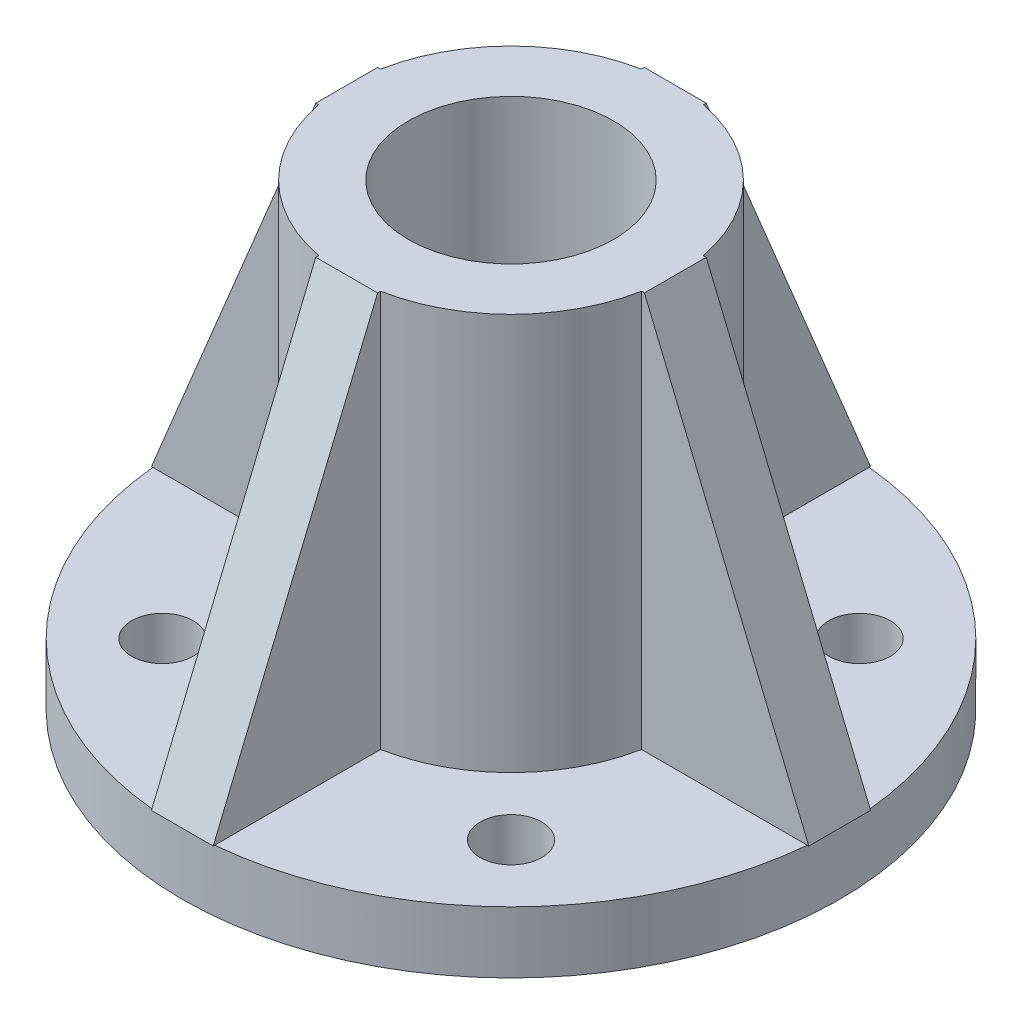
ISO-10303-21;
HEADER;
FILE_DESCRIPTION(('STEP AP214'),'2;1');
FILE_NAME('part.step','',(''),(''),'','','');
FILE_SCHEMA(('AUTOMOTIVE_DESIGN { 1 0 10303 214 1 1 1 1 }'));
ENDSEC;
DATA;
#1=APPLICATION_CONTEXT('core data for automotive mechanical design processes');
#2=APPLICATION_PROTOCOL_DEFINITION('international standard','automotive_design',2000,#1);
#3=PRODUCT_CONTEXT('',#1,'mechanical');
#4=PRODUCT('Part','Part','',(#3));
#5=PRODUCT_RELATED_PRODUCT_CATEGORY('part','',(#4));
#6=PRODUCT_DEFINITION_FORMATION('','',#4);
#7=PRODUCT_DEFINITION_CONTEXT('part definition',#1,'design');
#8=PRODUCT_DEFINITION('design','',#6,#7);
#9=PRODUCT_DEFINITION_SHAPE('','',#8);
#10=(LENGTH_UNIT() NAMED_UNIT(*) SI_UNIT(.MILLI.,.METRE.));
#11=(NAMED_UNIT(*) PLANE_ANGLE_UNIT() SI_UNIT($,.RADIAN.));
#12=(NAMED_UNIT(*) SI_UNIT($,.STERADIAN.) SOLID_ANGLE_UNIT());
#13=UNCERTAINTY_MEASURE_WITH_UNIT(LENGTH_MEASURE(1.E-05),#10,'distance_accuracy_value','');
#14=(GEOMETRIC_REPRESENTATION_CONTEXT(3) GLOBAL_UNCERTAINTY_ASSIGNED_CONTEXT((#13)) GLOBAL_UNIT_ASSIGNED_CONTEXT((#10,
#11,#12)) REPRESENTATION_CONTEXT('',''));
#15=CARTESIAN_POINT('',(0.,0.,0.));
#16=DIRECTION('',(0.,0.,1.));
#17=DIRECTION('',(1.,0.,0.));
#18=AXIS2_PLACEMENT_3D('',#15,#16,#17);
#19=CARTESIAN_POINT('',(0.,9.525,0.));
#20=DIRECTION('',(0.,1.,0.));
#21=DIRECTION('',(0.,0.,1.));
#22=AXIS2_PLACEMENT_3D('',#19,#20,#21);
#23=PLANE('',#22);
#24=CARTESIAN_POINT('',(26.940768363207,9.525,26.9407683632079));
#25=DIRECTION('',(0.,1.,0.));
#26=DIRECTION('',(0.,0.,1.));
#27=AXIS2_PLACEMENT_3D('',#24,#25,#26);
#28=CIRCLE('',#27,4.7625);
#29=CARTESIAN_POINT('',(26.940768363207,9.525,31.7032683632079));
#30=VERTEX_POINT('',#29);
#31=EDGE_CURVE('E464',#30,#30,#28,.T.);
#32=ORIENTED_EDGE('',*,*,#31,.F.);
#33=EDGE_LOOP('',(#32));
#34=FACE_BOUND('',#33,.T.);
#35=CARTESIAN_POINT('',(0.,9.525,0.));
#36=DIRECTION('',(0.,1.,0.));
#37=DIRECTION('',(0.,0.,1.));
#38=AXIS2_PLACEMENT_3D('',#35,#36,#37);
#39=CIRCLE('',#38,25.4);
#40=CARTESIAN_POINT('',(4.77519999999974,9.525,24.9470933168576));
#41=VERTEX_POINT('',#40);
#42=CARTESIAN_POINT('',(24.9470933168576,9.525,4.7752));
#43=VERTEX_POINT('',#42);
#44=EDGE_CURVE('E375',#41,#43,#39,.T.);
#45=ORIENTED_EDGE('',*,*,#44,.F.);
#46=DIRECTION('',(0.,0.,-1.));
#47=VECTOR('',#46,1.);
#48=CARTESIAN_POINT('',(4.77519999999947,9.525,50.8));
#49=LINE('',#48,#47);
#50=CARTESIAN_POINT('',(4.77519999999947,9.525,50.5750676219024));
#51=VERTEX_POINT('',#50);
#52=EDGE_CURVE('E215',#51,#41,#49,.T.);
#53=ORIENTED_EDGE('',*,*,#52,.F.);
#54=CARTESIAN_POINT('',(0.,9.525,0.));
#55=DIRECTION('',(0.,1.,0.));
#56=DIRECTION('',(0.,0.,1.));
#57=AXIS2_PLACEMENT_3D('',#54,#55,#56);
#58=CIRCLE('',#57,50.8);
#59=CARTESIAN_POINT('',(50.5750676219024,9.525,4.7752));
#60=VERTEX_POINT('',#59);
#61=EDGE_CURVE('E52',#51,#60,#58,.T.);
#62=ORIENTED_EDGE('',*,*,#61,.T.);
#63=DIRECTION('',(-1.,0.,0.));
#64=VECTOR('',#63,1.);
#65=CARTESIAN_POINT('',(50.8,9.525,4.7752));
#66=LINE('',#65,#64);
#67=EDGE_CURVE('E256',#60,#43,#66,.T.);
#68=ORIENTED_EDGE('',*,*,#67,.T.);
#69=EDGE_LOOP('',(#45,#53,#62,#68));
#70=FACE_BOUND('',#69,.T.);
#71=ADVANCED_FACE('F41',(#34,#70),#23,.T.);
#72=CARTESIAN_POINT('',(0.,213.574048968553,0.));
#73=DIRECTION('',(0.,-1.,0.));
#74=DIRECTION('',(0.,0.,-1.));
#75=AXIS2_PLACEMENT_3D('',#72,#73,#74);
#76=CYLINDRICAL_SURFACE('',#75,25.4);
#77=DIRECTION('',(0.,-1.,0.));
#78=VECTOR('',#77,1.);
#79=CARTESIAN_POINT('',(4.77519999999974,213.574048968553,24.9470933168576));
#80=LINE('',#79,#78);
#81=CARTESIAN_POINT('',(4.77519999999974,70.866,24.9470933168576));
#82=VERTEX_POINT('',#81);
#83=EDGE_CURVE('E59',#41,#82,#80,.F.);
#84=ORIENTED_EDGE('',*,*,#83,.F.);
#85=ORIENTED_EDGE('',*,*,#44,.T.);
#86=DIRECTION('',(0.,-1.,0.));
#87=VECTOR('',#86,1.);
#88=CARTESIAN_POINT('',(24.9470933168576,213.574048968553,4.7752));
#89=LINE('',#88,#87);
#90=CARTESIAN_POINT('',(24.9470933168576,70.866,4.7752));
#91=VERTEX_POINT('',#90);
#92=EDGE_CURVE('E267',#43,#91,#89,.F.);
#93=ORIENTED_EDGE('',*,*,#92,.T.);
#94=CARTESIAN_POINT('',(0.,70.866,0.));
#95=DIRECTION('',(0.,1.,0.));
#96=DIRECTION('',(0.,0.,1.));
#97=AXIS2_PLACEMENT_3D('',#94,#95,#96);
#98=CIRCLE('',#97,25.4);
#99=EDGE_CURVE('E370',#82,#91,#98,.T.);
#100=ORIENTED_EDGE('',*,*,#99,.F.);
#101=EDGE_LOOP('',(#84,#85,#93,#100));
#102=FACE_BOUND('',#101,.T.);
#103=ADVANCED_FACE('F475',(#102),#76,.T.);
#104=CARTESIAN_POINT('',(26.9407683632076,9.525,-26.9407683632073));
#105=DIRECTION('',(0.,1.,0.));
#106=DIRECTION('',(0.,0.,1.));
#107=AXIS2_PLACEMENT_3D('',#104,#105,#106);
#108=CIRCLE('',#107,4.7625);
#109=CARTESIAN_POINT('',(26.9407683632076,9.525,-22.1782683632073));
#110=VERTEX_POINT('',#109);
#111=EDGE_CURVE('E456',#110,#110,#108,.T.);
#112=ORIENTED_EDGE('',*,*,#111,.F.);
#113=EDGE_LOOP('',(#112));
#114=FACE_BOUND('',#113,.T.);
#115=CARTESIAN_POINT('',(24.9470933168576,9.525,-4.7752));
#116=VERTEX_POINT('',#115);
#117=CARTESIAN_POINT('',(4.77520000000009,9.525,-24.9470933168576));
#118=VERTEX_POINT('',#117);
#119=EDGE_CURVE('E483',#116,#118,#39,.T.);
#120=ORIENTED_EDGE('',*,*,#119,.F.);
#121=DIRECTION('',(-1.,0.,0.));
#122=VECTOR('',#121,1.);
#123=CARTESIAN_POINT('',(50.8,9.525,-4.7752));
#124=LINE('',#123,#122);
#125=CARTESIAN_POINT('',(50.5750676219024,9.525,-4.7752));
#126=VERTEX_POINT('',#125);
#127=EDGE_CURVE('E243',#126,#116,#124,.T.);
#128=ORIENTED_EDGE('',*,*,#127,.F.);
#129=CARTESIAN_POINT('',(4.77520000000018,9.525,-50.5750676219024));
#130=VERTEX_POINT('',#129);
#131=EDGE_CURVE('E409',#126,#130,#58,.T.);
#132=ORIENTED_EDGE('',*,*,#131,.T.);
#133=DIRECTION('',(0.,0.,1.));
#134=VECTOR('',#133,1.);
#135=CARTESIAN_POINT('',(4.77520000000018,9.525,-50.8));
#136=LINE('',#135,#134);
#137=EDGE_CURVE('E296',#130,#118,#136,.T.);
#138=ORIENTED_EDGE('',*,*,#137,.T.);
#139=EDGE_LOOP('',(#120,#128,#132,#138));
#140=FACE_BOUND('',#139,.T.);
#141=ADVANCED_FACE('F477',(#114,#140),#23,.T.);
#142=DIRECTION('',(0.,-1.,0.));
#143=VECTOR('',#142,1.);
#144=CARTESIAN_POINT('',(24.9470933168576,213.574048968553,-4.7752));
#145=LINE('',#144,#143);
#146=CARTESIAN_POINT('',(24.9470933168576,70.866,-4.7752));
#147=VERTEX_POINT('',#146);
#148=EDGE_CURVE('E271',#116,#147,#145,.F.);
#149=ORIENTED_EDGE('',*,*,#148,.F.);
#150=ORIENTED_EDGE('',*,*,#119,.T.);
#151=DIRECTION('',(0.,-1.,0.));
#152=VECTOR('',#151,1.);
#153=CARTESIAN_POINT('',(4.77520000000009,213.574048968553,-24.9470933168576));
#154=LINE('',#153,#152);
#155=CARTESIAN_POINT('',(4.77520000000009,70.866,-24.9470933168576));
#156=VERTEX_POINT('',#155);
#157=EDGE_CURVE('E307',#118,#156,#154,.F.);
#158=ORIENTED_EDGE('',*,*,#157,.T.);
#159=EDGE_CURVE('E518',#147,#156,#98,.T.);
#160=ORIENTED_EDGE('',*,*,#159,.F.);
#161=EDGE_LOOP('',(#149,#150,#158,#160));
#162=FACE_BOUND('',#161,.T.);
#163=ADVANCED_FACE('F517',(#162),#76,.T.);
#164=CARTESIAN_POINT('',(-26.9407683632072,9.525,-26.9407683632077));
#165=DIRECTION('',(0.,1.,0.));
#166=DIRECTION('',(0.,0.,1.));
#167=AXIS2_PLACEMENT_3D('',#164,#165,#166);
#168=CIRCLE('',#167,4.7625);
#169=CARTESIAN_POINT('',(-26.9407683632072,9.525,-22.1782683632077));
#170=VERTEX_POINT('',#169);
#171=EDGE_CURVE('E448',#170,#170,#168,.T.);
#172=ORIENTED_EDGE('',*,*,#171,.F.);
#173=EDGE_LOOP('',(#172));
#174=FACE_BOUND('',#173,.T.);
#175=CARTESIAN_POINT('',(-4.77519999999991,9.525,-24.9470933168576));
#176=VERTEX_POINT('',#175);
#177=CARTESIAN_POINT('',(-24.9470933168576,9.525,-4.7752));
#178=VERTEX_POINT('',#177);
#179=EDGE_CURVE('E376',#176,#178,#39,.T.);
#180=ORIENTED_EDGE('',*,*,#179,.F.);
#181=DIRECTION('',(0.,0.,1.));
#182=VECTOR('',#181,1.);
#183=CARTESIAN_POINT('',(-4.77519999999982,9.525,-50.8));
#184=LINE('',#183,#182);
#185=CARTESIAN_POINT('',(-4.77519999999982,9.525,-50.5750676219024));
#186=VERTEX_POINT('',#185);
#187=EDGE_CURVE('E283',#186,#176,#184,.T.);
#188=ORIENTED_EDGE('',*,*,#187,.F.);
#189=CARTESIAN_POINT('',(-50.5750676219024,9.525,-4.7752));
#190=VERTEX_POINT('',#189);
#191=EDGE_CURVE('E386',#186,#190,#58,.T.);
#192=ORIENTED_EDGE('',*,*,#191,.T.);
#193=DIRECTION('',(1.,0.,0.));
#194=VECTOR('',#193,1.);
#195=CARTESIAN_POINT('',(-50.8,9.525,-4.7752));
#196=LINE('',#195,#194);
#197=EDGE_CURVE('E344',#190,#178,#196,.T.);
#198=ORIENTED_EDGE('',*,*,#197,.T.);
#199=EDGE_LOOP('',(#180,#188,#192,#198));
#200=FACE_BOUND('',#199,.T.);
#201=ADVANCED_FACE('F498',(#174,#200),#23,.T.);
#202=DIRECTION('',(0.,-1.,0.));
#203=VECTOR('',#202,1.);
#204=CARTESIAN_POINT('',(-4.77519999999991,213.574048968553,-24.9470933168576));
#205=LINE('',#204,#203);
#206=CARTESIAN_POINT('',(-4.77519999999991,70.866,-24.9470933168576));
#207=VERTEX_POINT('',#206);
#208=EDGE_CURVE('E311',#176,#207,#205,.F.);
#209=ORIENTED_EDGE('',*,*,#208,.F.);
#210=ORIENTED_EDGE('',*,*,#179,.T.);
#211=DIRECTION('',(0.,-1.,0.));
#212=VECTOR('',#211,1.);
#213=CARTESIAN_POINT('',(-24.9470933168576,213.574048968553,-4.7752));
#214=LINE('',#213,#212);
#215=CARTESIAN_POINT('',(-24.9470933168576,70.866,-4.7752));
#216=VERTEX_POINT('',#215);
#217=EDGE_CURVE('E355',#178,#216,#214,.F.);
#218=ORIENTED_EDGE('',*,*,#217,.T.);
#219=EDGE_CURVE('E371',#207,#216,#98,.T.);
#220=ORIENTED_EDGE('',*,*,#219,.F.);
#221=EDGE_LOOP('',(#209,#210,#218,#220));
#222=FACE_BOUND('',#221,.T.);
#223=ADVANCED_FACE('F491',(#222),#76,.T.);
#224=DIRECTION('',(0.,0.,-1.));
#225=VECTOR('',#224,1.);
#226=CARTESIAN_POINT('',(-4.77520000000053,9.525,50.7999999999999));
#227=LINE('',#226,#225);
#228=CARTESIAN_POINT('',(-4.77520000000053,9.525,50.5750676219023));
#229=VERTEX_POINT('',#228);
#230=CARTESIAN_POINT('',(-4.77520000000026,9.525,24.9470933168575));
#231=VERTEX_POINT('',#230);
#232=EDGE_CURVE('E67',#229,#231,#227,.T.);
#233=ORIENTED_EDGE('',*,*,#232,.T.);
#234=CARTESIAN_POINT('',(-24.9470933168576,9.525,4.7752));
#235=VERTEX_POINT('',#234);
#236=EDGE_CURVE('E372',#235,#231,#39,.T.);
#237=ORIENTED_EDGE('',*,*,#236,.F.);
#238=DIRECTION('',(1.,0.,0.));
#239=VECTOR('',#238,1.);
#240=CARTESIAN_POINT('',(-50.8,9.525,4.7752));
#241=LINE('',#240,#239);
#242=CARTESIAN_POINT('',(-50.5750676219024,9.525,4.7752));
#243=VERTEX_POINT('',#242);
#244=EDGE_CURVE('E331',#243,#235,#241,.T.);
#245=ORIENTED_EDGE('',*,*,#244,.F.);
#246=EDGE_CURVE('E51',#243,#229,#58,.T.);
#247=ORIENTED_EDGE('',*,*,#246,.T.);
#248=EDGE_LOOP('',(#233,#237,#245,#247));
#249=FACE_BOUND('',#248,.T.);
#250=CARTESIAN_POINT('',(-26.9407683632076,9.525,26.9407683632073));
#251=DIRECTION('',(0.,1.,0.));
#252=DIRECTION('',(0.,0.,1.));
#253=AXIS2_PLACEMENT_3D('',#250,#251,#252);
#254=CIRCLE('',#253,4.7625);
#255=CARTESIAN_POINT('',(-26.9407683632076,9.525,31.7032683632073));
#256=VERTEX_POINT('',#255);
#257=EDGE_CURVE('E315',#256,#256,#254,.T.);
#258=ORIENTED_EDGE('',*,*,#257,.F.);
#259=EDGE_LOOP('',(#258));
#260=FACE_BOUND('',#259,.T.);
#261=ADVANCED_FACE('F478',(#249,#260),#23,.T.);
#262=ORIENTED_EDGE('',*,*,#236,.T.);
#263=DIRECTION('',(0.,-1.,0.));
#264=VECTOR('',#263,1.);
#265=CARTESIAN_POINT('',(-4.77520000000026,213.574048968553,24.9470933168575));
#266=LINE('',#265,#264);
#267=CARTESIAN_POINT('',(-4.77520000000026,70.866,24.9470933168575));
#268=VERTEX_POINT('',#267);
#269=EDGE_CURVE('E224',#231,#268,#266,.F.);
#270=ORIENTED_EDGE('',*,*,#269,.T.);
#271=CARTESIAN_POINT('',(-24.9470933168576,70.866,4.7752));
#272=VERTEX_POINT('',#271);
#273=EDGE_CURVE('E366',#272,#268,#98,.T.);
#274=ORIENTED_EDGE('',*,*,#273,.F.);
#275=DIRECTION('',(0.,-1.,0.));
#276=VECTOR('',#275,1.);
#277=CARTESIAN_POINT('',(-24.9470933168576,213.574048968553,4.7752));
#278=LINE('',#277,#276);
#279=EDGE_CURVE('E359',#235,#272,#278,.F.);
#280=ORIENTED_EDGE('',*,*,#279,.F.);
#281=EDGE_LOOP('',(#262,#270,#274,#280));
#282=FACE_BOUND('',#281,.T.);
#283=ADVANCED_FACE('F570',(#282),#76,.T.);
#284=CARTESIAN_POINT('',(0.,0.,0.));
#285=DIRECTION('',(0.,1.,0.));
#286=DIRECTION('',(0.,0.,1.));
#287=AXIS2_PLACEMENT_3D('',#284,#285,#286);
#288=PLANE('',#287);
#289=CARTESIAN_POINT('',(26.940768363207,0.,26.9407683632079));
#290=DIRECTION('',(0.,1.,0.));
#291=DIRECTION('',(0.,0.,1.));
#292=AXIS2_PLACEMENT_3D('',#289,#290,#291);
#293=CIRCLE('',#292,4.7625);
#294=CARTESIAN_POINT('',(26.940768363207,0.,31.7032683632079));
#295=VERTEX_POINT('',#294);
#296=EDGE_CURVE('E460',#295,#295,#293,.T.);
#297=ORIENTED_EDGE('',*,*,#296,.T.);
#298=EDGE_LOOP('',(#297));
#299=FACE_BOUND('',#298,.T.);
#300=CARTESIAN_POINT('',(26.9407683632076,0.,-26.9407683632073));
#301=DIRECTION('',(0.,1.,0.));
#302=DIRECTION('',(0.,0.,1.));
#303=AXIS2_PLACEMENT_3D('',#300,#301,#302);
#304=CIRCLE('',#303,4.7625);
#305=CARTESIAN_POINT('',(26.9407683632076,0.,-22.1782683632073));
#306=VERTEX_POINT('',#305);
#307=EDGE_CURVE('E452',#306,#306,#304,.T.);
#308=ORIENTED_EDGE('',*,*,#307,.T.);
#309=EDGE_LOOP('',(#308));
#310=FACE_BOUND('',#309,.T.);
#311=CARTESIAN_POINT('',(-26.9407683632072,0.,-26.9407683632077));
#312=DIRECTION('',(0.,1.,0.));
#313=DIRECTION('',(0.,0.,1.));
#314=AXIS2_PLACEMENT_3D('',#311,#312,#313);
#315=CIRCLE('',#314,4.7625);
#316=CARTESIAN_POINT('',(-26.9407683632072,0.,-22.1782683632077));
#317=VERTEX_POINT('',#316);
#318=EDGE_CURVE('E440',#317,#317,#315,.T.);
#319=ORIENTED_EDGE('',*,*,#318,.T.);
#320=EDGE_LOOP('',(#319));
#321=FACE_BOUND('',#320,.T.);
#322=CARTESIAN_POINT('',(-26.9407683632076,0.,26.9407683632073));
#323=DIRECTION('',(0.,1.,0.));
#324=DIRECTION('',(0.,0.,1.));
#325=AXIS2_PLACEMENT_3D('',#322,#323,#324);
#326=CIRCLE('',#325,4.7625);
#327=CARTESIAN_POINT('',(-26.9407683632076,0.,31.7032683632073));
#328=VERTEX_POINT('',#327);
#329=EDGE_CURVE('E319',#328,#328,#326,.T.);
#330=ORIENTED_EDGE('',*,*,#329,.T.);
#331=EDGE_LOOP('',(#330));
#332=FACE_BOUND('',#331,.T.);
#333=CARTESIAN_POINT('',(0.,0.,0.));
#334=DIRECTION('',(0.,1.,0.));
#335=DIRECTION('',(0.,0.,1.));
#336=AXIS2_PLACEMENT_3D('',#333,#334,#335);
#337=CIRCLE('',#336,50.8);
#338=CARTESIAN_POINT('',(0.,0.,50.8));
#339=VERTEX_POINT('',#338);
#340=EDGE_CURVE('E45',#339,#339,#337,.T.);
#341=ORIENTED_EDGE('',*,*,#340,.F.);
#342=EDGE_LOOP('',(#341));
#343=FACE_BOUND('',#342,.T.);
#344=CARTESIAN_POINT('',(0.,0.,0.));
#345=DIRECTION('',(0.,1.,0.));
#346=DIRECTION('',(0.,0.,1.));
#347=AXIS2_PLACEMENT_3D('',#344,#345,#346);
#348=CIRCLE('',#347,15.875);
#349=CARTESIAN_POINT('',(0.,0.,15.875));
#350=VERTEX_POINT('',#349);
#351=EDGE_CURVE('E369',#350,#350,#348,.T.);
#352=ORIENTED_EDGE('',*,*,#351,.T.);
#353=EDGE_LOOP('',(#352));
#354=FACE_BOUND('',#353,.T.);
#355=ADVANCED_FACE('F573',(#299,#310,#321,#332,#343,#354),#288,.F.);
#356=CARTESIAN_POINT('',(0.,9.525,0.));
#357=DIRECTION('',(0.,-1.,0.));
#358=DIRECTION('',(0.,0.,-1.));
#359=AXIS2_PLACEMENT_3D('',#356,#357,#358);
#360=CYLINDRICAL_SURFACE('',#359,50.8);
#361=CARTESIAN_POINT('',(-50.8,9.525,0.));
#362=VERTEX_POINT('',#361);
#363=EDGE_CURVE('E12',#190,#362,#58,.T.);
#364=ORIENTED_EDGE('',*,*,#363,.F.);
#365=ORIENTED_EDGE('',*,*,#191,.F.);
#366=CARTESIAN_POINT('',(1.77367252013231E-13,9.525,-50.8));
#367=VERTEX_POINT('',#366);
#368=EDGE_CURVE('E390',#367,#186,#58,.T.);
#369=ORIENTED_EDGE('',*,*,#368,.F.);
#370=EDGE_CURVE('E398',#130,#367,#58,.T.);
#371=ORIENTED_EDGE('',*,*,#370,.F.);
#372=ORIENTED_EDGE('',*,*,#131,.F.);
#373=CARTESIAN_POINT('',(50.8,9.525,0.));
#374=VERTEX_POINT('',#373);
#375=EDGE_CURVE('E401',#374,#126,#58,.T.);
#376=ORIENTED_EDGE('',*,*,#375,.F.);
#377=EDGE_CURVE('E391',#60,#374,#58,.T.);
#378=ORIENTED_EDGE('',*,*,#377,.F.);
#379=ORIENTED_EDGE('',*,*,#61,.F.);
#380=CARTESIAN_POINT('',(-5.32101756039693E-13,9.525,50.8));
#381=VERTEX_POINT('',#380);
#382=EDGE_CURVE('E407',#381,#51,#58,.T.);
#383=ORIENTED_EDGE('',*,*,#382,.F.);
#384=EDGE_CURVE('E413',#229,#381,#58,.T.);
#385=ORIENTED_EDGE('',*,*,#384,.F.);
#386=ORIENTED_EDGE('',*,*,#246,.F.);
#387=CARTESIAN_POINT('',(0.,9.525,0.));
#388=DIRECTION('',(0.,1.,0.));
#389=DIRECTION('',(0.,0.,1.));
#390=AXIS2_PLACEMENT_3D('',#387,#388,#389);
#391=CIRCLE('',#390,50.8);
#392=EDGE_CURVE('E362',#362,#243,#391,.T.);
#393=ORIENTED_EDGE('',*,*,#392,.F.);
#394=EDGE_LOOP('',(#364,#365,#369,#371,#372,#376,#378,#379,#383,#385,#386,#393));
#395=FACE_BOUND('',#394,.T.);
#396=ORIENTED_EDGE('',*,*,#340,.T.);
#397=EDGE_LOOP('',(#396));
#398=FACE_BOUND('',#397,.T.);
#399=ADVANCED_FACE('F43',(#395,#398),#360,.T.);
#400=CARTESIAN_POINT('',(0.,9.525,0.));
#401=DIRECTION('',(0.,-1.,0.));
#402=DIRECTION('',(0.,0.,-1.));
#403=AXIS2_PLACEMENT_3D('',#400,#401,#402);
#404=CYLINDRICAL_SURFACE('',#403,15.875);
#405=ORIENTED_EDGE('',*,*,#351,.F.);
#406=EDGE_LOOP('',(#405));
#407=FACE_BOUND('',#406,.T.);
#408=CARTESIAN_POINT('',(0.,70.866,0.));
#409=DIRECTION('',(0.,1.,0.));
#410=DIRECTION('',(0.,0.,1.));
#411=AXIS2_PLACEMENT_3D('',#408,#409,#410);
#412=CIRCLE('',#411,15.875);
#413=CARTESIAN_POINT('',(0.,70.866,15.875));
#414=VERTEX_POINT('',#413);
#415=EDGE_CURVE('E365',#414,#414,#412,.T.);
#416=ORIENTED_EDGE('',*,*,#415,.T.);
#417=EDGE_LOOP('',(#416));
#418=FACE_BOUND('',#417,.T.);
#419=ADVANCED_FACE('F569',(#407,#418),#404,.F.);
#420=CARTESIAN_POINT('',(0.,70.866,0.));
#421=DIRECTION('',(0.,1.,0.));
#422=DIRECTION('',(0.,0.,1.));
#423=AXIS2_PLACEMENT_3D('',#420,#421,#422);
#424=PLANE('',#423);
#425=DIRECTION('',(0.,0.,1.));
#426=VECTOR('',#425,1.);
#427=CARTESIAN_POINT('',(-4.77520000000024,70.866,22.5833661390254));
#428=LINE('',#427,#426);
#429=CARTESIAN_POINT('',(-4.77520000000027,70.866,25.3999999999999));
#430=VERTEX_POINT('',#429);
#431=EDGE_CURVE('E221',#268,#430,#428,.T.);
#432=ORIENTED_EDGE('',*,*,#431,.T.);
#433=DIRECTION('',(-1.,0.,0.));
#434=VECTOR('',#433,1.);
#435=CARTESIAN_POINT('',(4.77519999999973,70.866,25.4000000000001));
#436=LINE('',#435,#434);
#437=CARTESIAN_POINT('',(4.77519999999973,70.866,25.4000000000001));
#438=VERTEX_POINT('',#437);
#439=EDGE_CURVE('E208',#438,#430,#436,.T.);
#440=ORIENTED_EDGE('',*,*,#439,.F.);
#441=DIRECTION('',(0.,0.,1.));
#442=VECTOR('',#441,1.);
#443=CARTESIAN_POINT('',(4.77519999999976,70.866,22.5833661390255));
#444=LINE('',#443,#442);
#445=EDGE_CURVE('E193',#82,#438,#444,.T.);
#446=ORIENTED_EDGE('',*,*,#445,.F.);
#447=ORIENTED_EDGE('',*,*,#99,.T.);
#448=DIRECTION('',(1.,0.,0.));
#449=VECTOR('',#448,1.);
#450=CARTESIAN_POINT('',(22.5833661390254,70.866,4.7752));
#451=LINE('',#450,#449);
#452=CARTESIAN_POINT('',(25.4,70.866,4.7752));
#453=VERTEX_POINT('',#452);
#454=EDGE_CURVE('E235',#91,#453,#451,.T.);
#455=ORIENTED_EDGE('',*,*,#454,.T.);
#456=DIRECTION('',(0.,0.,1.));
#457=VECTOR('',#456,1.);
#458=CARTESIAN_POINT('',(25.4,70.866,-4.7752));
#459=LINE('',#458,#457);
#460=CARTESIAN_POINT('',(25.4,70.866,-4.7752));
#461=VERTEX_POINT('',#460);
#462=EDGE_CURVE('E264',#461,#453,#459,.T.);
#463=ORIENTED_EDGE('',*,*,#462,.F.);
#464=DIRECTION('',(1.,0.,0.));
#465=VECTOR('',#464,1.);
#466=CARTESIAN_POINT('',(22.5833661390254,70.866,-4.7752));
#467=LINE('',#466,#465);
#468=EDGE_CURVE('E236',#147,#461,#467,.T.);
#469=ORIENTED_EDGE('',*,*,#468,.F.);
#470=ORIENTED_EDGE('',*,*,#159,.T.);
#471=DIRECTION('',(0.,0.,-1.));
#472=VECTOR('',#471,1.);
#473=CARTESIAN_POINT('',(4.77520000000008,70.866,-22.5833661390254));
#474=LINE('',#473,#472);
#475=CARTESIAN_POINT('',(4.77520000000009,70.866,-25.4));
#476=VERTEX_POINT('',#475);
#477=EDGE_CURVE('E275',#156,#476,#474,.T.);
#478=ORIENTED_EDGE('',*,*,#477,.T.);
#479=DIRECTION('',(1.,0.,0.));
#480=VECTOR('',#479,1.);
#481=CARTESIAN_POINT('',(-4.77519999999991,70.866,-25.4));
#482=LINE('',#481,#480);
#483=CARTESIAN_POINT('',(-4.77519999999991,70.866,-25.4));
#484=VERTEX_POINT('',#483);
#485=EDGE_CURVE('E304',#484,#476,#482,.T.);
#486=ORIENTED_EDGE('',*,*,#485,.F.);
#487=DIRECTION('',(0.,0.,-1.));
#488=VECTOR('',#487,1.);
#489=CARTESIAN_POINT('',(-4.77519999999992,70.866,-22.5833661390254));
#490=LINE('',#489,#488);
#491=EDGE_CURVE('E276',#207,#484,#490,.T.);
#492=ORIENTED_EDGE('',*,*,#491,.F.);
#493=ORIENTED_EDGE('',*,*,#219,.T.);
#494=DIRECTION('',(-1.,0.,0.));
#495=VECTOR('',#494,1.);
#496=CARTESIAN_POINT('',(-22.5833661390254,70.866,-4.7752));
#497=LINE('',#496,#495);
#498=CARTESIAN_POINT('',(-25.4,70.866,-4.7752));
#499=VERTEX_POINT('',#498);
#500=EDGE_CURVE('E323',#216,#499,#497,.T.);
#501=ORIENTED_EDGE('',*,*,#500,.T.);
#502=DIRECTION('',(0.,0.,-1.));
#503=VECTOR('',#502,1.);
#504=CARTESIAN_POINT('',(-25.4,70.866,4.7752));
#505=LINE('',#504,#503);
#506=CARTESIAN_POINT('',(-25.4,70.866,4.7752));
#507=VERTEX_POINT('',#506);
#508=EDGE_CURVE('E352',#507,#499,#505,.T.);
#509=ORIENTED_EDGE('',*,*,#508,.F.);
#510=DIRECTION('',(-1.,0.,0.));
#511=VECTOR('',#510,1.);
#512=CARTESIAN_POINT('',(-22.5833661390254,70.866,4.7752));
#513=LINE('',#512,#511);
#514=EDGE_CURVE('E324',#272,#507,#513,.T.);
#515=ORIENTED_EDGE('',*,*,#514,.F.);
#516=ORIENTED_EDGE('',*,*,#273,.T.);
#517=EDGE_LOOP('',(#432,#440,#446,#447,#455,#463,#469,#470,#478,#486,#492,#493,#501,#509,#515,#516));
#518=FACE_BOUND('',#517,.T.);
#519=ORIENTED_EDGE('',*,*,#415,.F.);
#520=EDGE_LOOP('',(#519));
#521=FACE_BOUND('',#520,.T.);
#522=ADVANCED_FACE('F217',(#518,#521),#424,.T.);
#523=CARTESIAN_POINT('',(-50.8,9.525,4.7752));
#524=DIRECTION('',(0.,1.,0.));
#525=DIRECTION('',(0.,0.,1.));
#526=AXIS2_PLACEMENT_3D('',#523,#524,#525);
#527=PLANE('',#526);
#528=CARTESIAN_POINT('',(-50.8,9.525,-4.7752));
#529=VERTEX_POINT('',#528);
#530=EDGE_CURVE('E328',#529,#190,#196,.T.);
#531=ORIENTED_EDGE('',*,*,#530,.T.);
#532=ORIENTED_EDGE('',*,*,#363,.T.);
#533=DIRECTION('',(0.,0.,-1.));
#534=VECTOR('',#533,1.);
#535=CARTESIAN_POINT('',(-50.8,9.525,4.7752));
#536=LINE('',#535,#534);
#537=EDGE_CURVE('E336',#362,#529,#536,.T.);
#538=ORIENTED_EDGE('',*,*,#537,.T.);
#539=EDGE_LOOP('',(#531,#532,#538));
#540=FACE_BOUND('',#539,.T.);
#541=ADVANCED_FACE('F556',(#540),#527,.F.);
#542=CARTESIAN_POINT('',(0.,0.,4.7752));
#543=DIRECTION('',(0.,0.,-1.));
#544=DIRECTION('',(-1.,0.,0.));
#545=AXIS2_PLACEMENT_3D('',#542,#543,#544);
#546=PLANE('',#545);
#547=ORIENTED_EDGE('',*,*,#244,.T.);
#548=ORIENTED_EDGE('',*,*,#279,.T.);
#549=ORIENTED_EDGE('',*,*,#514,.T.);
#550=DIRECTION('',(-0.382577055162233,-0.923923588216793,0.));
#551=VECTOR('',#550,1.);
#552=CARTESIAN_POINT('',(-25.4,70.866,4.7752));
#553=LINE('',#552,#551);
#554=CARTESIAN_POINT('',(-50.8,9.525,4.7752));
#555=VERTEX_POINT('',#554);
#556=EDGE_CURVE('E327',#507,#555,#553,.T.);
#557=ORIENTED_EDGE('',*,*,#556,.T.);
#558=EDGE_CURVE('E332',#555,#243,#241,.T.);
#559=ORIENTED_EDGE('',*,*,#558,.T.);
#560=EDGE_LOOP('',(#547,#548,#549,#557,#559));
#561=FACE_BOUND('',#560,.T.);
#562=ADVANCED_FACE('F553',(#561),#546,.F.);
#563=CARTESIAN_POINT('',(0.,0.,-4.7752));
#564=DIRECTION('',(0.,0.,-1.));
#565=DIRECTION('',(-1.,0.,0.));
#566=AXIS2_PLACEMENT_3D('',#563,#564,#565);
#567=PLANE('',#566);
#568=ORIENTED_EDGE('',*,*,#217,.F.);
#569=ORIENTED_EDGE('',*,*,#197,.F.);
#570=ORIENTED_EDGE('',*,*,#530,.F.);
#571=DIRECTION('',(-0.382577055162233,-0.923923588216793,0.));
#572=VECTOR('',#571,1.);
#573=CARTESIAN_POINT('',(-25.4,70.866,-4.7752));
#574=LINE('',#573,#572);
#575=EDGE_CURVE('E340',#499,#529,#574,.T.);
#576=ORIENTED_EDGE('',*,*,#575,.F.);
#577=ORIENTED_EDGE('',*,*,#500,.F.);
#578=EDGE_LOOP('',(#568,#569,#570,#576,#577));
#579=FACE_BOUND('',#578,.T.);
#580=ADVANCED_FACE('F495',(#579),#567,.T.);
#581=CARTESIAN_POINT('',(-25.4,70.866,4.7752));
#582=DIRECTION('',(0.923923588216793,-0.382577055162233,0.));
#583=DIRECTION('',(0.382577055162233,0.923923588216793,0.));
#584=AXIS2_PLACEMENT_3D('',#581,#582,#583);
#585=PLANE('',#584);
#586=ORIENTED_EDGE('',*,*,#575,.T.);
#587=ORIENTED_EDGE('',*,*,#537,.F.);
#588=EDGE_CURVE('E348',#555,#362,#536,.T.);
#589=ORIENTED_EDGE('',*,*,#588,.F.);
#590=ORIENTED_EDGE('',*,*,#556,.F.);
#591=ORIENTED_EDGE('',*,*,#508,.T.);
#592=EDGE_LOOP('',(#586,#587,#589,#590,#591));
#593=FACE_BOUND('',#592,.T.);
#594=ADVANCED_FACE('F560',(#593),#585,.F.);
#595=ORIENTED_EDGE('',*,*,#588,.T.);
#596=ORIENTED_EDGE('',*,*,#392,.T.);
#597=ORIENTED_EDGE('',*,*,#558,.F.);
#598=EDGE_LOOP('',(#595,#596,#597));
#599=FACE_BOUND('',#598,.T.);
#600=ADVANCED_FACE('F551',(#599),#527,.F.);
#601=CARTESIAN_POINT('',(-26.9407683632076,9.525,26.9407683632073));
#602=DIRECTION('',(0.,1.,0.));
#603=DIRECTION('',(0.,0.,1.));
#604=AXIS2_PLACEMENT_3D('',#601,#602,#603);
#605=CYLINDRICAL_SURFACE('',#604,4.7625);
#606=ORIENTED_EDGE('',*,*,#257,.T.);
#607=EDGE_LOOP('',(#606));
#608=FACE_BOUND('',#607,.T.);
#609=ORIENTED_EDGE('',*,*,#329,.F.);
#610=EDGE_LOOP('',(#609));
#611=FACE_BOUND('',#610,.T.);
#612=ADVANCED_FACE('F548',(#608,#611),#605,.F.);
#613=CARTESIAN_POINT('',(-4.77519999999982,9.525,-50.8));
#614=DIRECTION('',(0.,1.,0.));
#615=DIRECTION('',(0.,0.,1.));
#616=AXIS2_PLACEMENT_3D('',#613,#614,#615);
#617=PLANE('',#616);
#618=CARTESIAN_POINT('',(4.77520000000018,9.525,-50.8));
#619=VERTEX_POINT('',#618);
#620=EDGE_CURVE('E280',#619,#130,#136,.T.);
#621=ORIENTED_EDGE('',*,*,#620,.T.);
#622=ORIENTED_EDGE('',*,*,#370,.T.);
#623=DIRECTION('',(1.,0.,0.));
#624=VECTOR('',#623,1.);
#625=CARTESIAN_POINT('',(-4.77519999999982,9.525,-50.8));
#626=LINE('',#625,#624);
#627=EDGE_CURVE('E288',#367,#619,#626,.T.);
#628=ORIENTED_EDGE('',*,*,#627,.T.);
#629=EDGE_LOOP('',(#621,#622,#628));
#630=FACE_BOUND('',#629,.T.);
#631=ADVANCED_FACE('F535',(#630),#617,.F.);
#632=CARTESIAN_POINT('',(-4.7752,0.,0.));
#633=DIRECTION('',(1.,0.,0.));
#634=DIRECTION('',(0.,0.,-1.));
#635=AXIS2_PLACEMENT_3D('',#632,#633,#634);
#636=PLANE('',#635);
#637=ORIENTED_EDGE('',*,*,#187,.T.);
#638=ORIENTED_EDGE('',*,*,#208,.T.);
#639=ORIENTED_EDGE('',*,*,#491,.T.);
#640=DIRECTION('',(0.,-0.923923588216793,-0.382577055162233));
#641=VECTOR('',#640,1.);
#642=CARTESIAN_POINT('',(-4.77519999999991,70.866,-25.4));
#643=LINE('',#642,#641);
#644=CARTESIAN_POINT('',(-4.77519999999982,9.525,-50.8));
#645=VERTEX_POINT('',#644);
#646=EDGE_CURVE('E279',#484,#645,#643,.T.);
#647=ORIENTED_EDGE('',*,*,#646,.T.);
#648=EDGE_CURVE('E284',#645,#186,#184,.T.);
#649=ORIENTED_EDGE('',*,*,#648,.T.);
#650=EDGE_LOOP('',(#637,#638,#639,#647,#649));
#651=FACE_BOUND('',#650,.T.);
#652=ADVANCED_FACE('F526',(#651),#636,.F.);
#653=CARTESIAN_POINT('',(4.7752,0.,0.));
#654=DIRECTION('',(1.,0.,0.));
#655=DIRECTION('',(0.,0.,-1.));
#656=AXIS2_PLACEMENT_3D('',#653,#654,#655);
#657=PLANE('',#656);
#658=ORIENTED_EDGE('',*,*,#157,.F.);
#659=ORIENTED_EDGE('',*,*,#137,.F.);
#660=ORIENTED_EDGE('',*,*,#620,.F.);
#661=DIRECTION('',(0.,-0.923923588216793,-0.382577055162233));
#662=VECTOR('',#661,1.);
#663=CARTESIAN_POINT('',(4.77520000000009,70.866,-25.4));
#664=LINE('',#663,#662);
#665=EDGE_CURVE('E292',#476,#619,#664,.T.);
#666=ORIENTED_EDGE('',*,*,#665,.F.);
#667=ORIENTED_EDGE('',*,*,#477,.F.);
#668=EDGE_LOOP('',(#658,#659,#660,#666,#667));
#669=FACE_BOUND('',#668,.T.);
#670=ADVANCED_FACE('F515',(#669),#657,.T.);
#671=CARTESIAN_POINT('',(-4.77519999999991,70.866,-25.4));
#672=DIRECTION('',(0.,-0.382577055162233,0.923923588216793));
#673=DIRECTION('',(0.,-0.923923588216793,-0.382577055162233));
#674=AXIS2_PLACEMENT_3D('',#671,#672,#673);
#675=PLANE('',#674);
#676=ORIENTED_EDGE('',*,*,#665,.T.);
#677=ORIENTED_EDGE('',*,*,#627,.F.);
#678=EDGE_CURVE('E300',#645,#367,#626,.T.);
#679=ORIENTED_EDGE('',*,*,#678,.F.);
#680=ORIENTED_EDGE('',*,*,#646,.F.);
#681=ORIENTED_EDGE('',*,*,#485,.T.);
#682=EDGE_LOOP('',(#676,#677,#679,#680,#681));
#683=FACE_BOUND('',#682,.T.);
#684=ADVANCED_FACE('F537',(#683),#675,.F.);
#685=ORIENTED_EDGE('',*,*,#678,.T.);
#686=ORIENTED_EDGE('',*,*,#368,.T.);
#687=ORIENTED_EDGE('',*,*,#648,.F.);
#688=EDGE_LOOP('',(#685,#686,#687));
#689=FACE_BOUND('',#688,.T.);
#690=ADVANCED_FACE('F530',(#689),#617,.F.);
#691=CARTESIAN_POINT('',(50.8,9.525,-4.7752));
#692=DIRECTION('',(0.,1.,0.));
#693=DIRECTION('',(0.,0.,1.));
#694=AXIS2_PLACEMENT_3D('',#691,#692,#693);
#695=PLANE('',#694);
#696=CARTESIAN_POINT('',(50.8,9.525,4.7752));
#697=VERTEX_POINT('',#696);
#698=EDGE_CURVE('E240',#697,#60,#66,.T.);
#699=ORIENTED_EDGE('',*,*,#698,.T.);
#700=ORIENTED_EDGE('',*,*,#377,.T.);
#701=DIRECTION('',(0.,0.,1.));
#702=VECTOR('',#701,1.);
#703=CARTESIAN_POINT('',(50.8,9.525,-4.7752));
#704=LINE('',#703,#702);
#705=EDGE_CURVE('E248',#374,#697,#704,.T.);
#706=ORIENTED_EDGE('',*,*,#705,.T.);
#707=EDGE_LOOP('',(#699,#700,#706));
#708=FACE_BOUND('',#707,.T.);
#709=ADVANCED_FACE('F544',(#708),#695,.F.);
#710=CARTESIAN_POINT('',(0.,0.,-4.7752));
#711=DIRECTION('',(0.,0.,1.));
#712=DIRECTION('',(1.,0.,0.));
#713=AXIS2_PLACEMENT_3D('',#710,#711,#712);
#714=PLANE('',#713);
#715=ORIENTED_EDGE('',*,*,#127,.T.);
#716=ORIENTED_EDGE('',*,*,#148,.T.);
#717=ORIENTED_EDGE('',*,*,#468,.T.);
#718=DIRECTION('',(0.382577055162233,-0.923923588216793,0.));
#719=VECTOR('',#718,1.);
#720=CARTESIAN_POINT('',(25.4,70.866,-4.7752));
#721=LINE('',#720,#719);
#722=CARTESIAN_POINT('',(50.8,9.525,-4.7752));
#723=VERTEX_POINT('',#722);
#724=EDGE_CURVE('E239',#461,#723,#721,.T.);
#725=ORIENTED_EDGE('',*,*,#724,.T.);
#726=EDGE_CURVE('E244',#723,#126,#124,.T.);
#727=ORIENTED_EDGE('',*,*,#726,.T.);
#728=EDGE_LOOP('',(#715,#716,#717,#725,#727));
#729=FACE_BOUND('',#728,.T.);
#730=ADVANCED_FACE('F508',(#729),#714,.F.);
#731=CARTESIAN_POINT('',(0.,0.,4.7752));
#732=DIRECTION('',(0.,0.,1.));
#733=DIRECTION('',(1.,0.,0.));
#734=AXIS2_PLACEMENT_3D('',#731,#732,#733);
#735=PLANE('',#734);
#736=ORIENTED_EDGE('',*,*,#92,.F.);
#737=ORIENTED_EDGE('',*,*,#67,.F.);
#738=ORIENTED_EDGE('',*,*,#698,.F.);
#739=DIRECTION('',(0.382577055162233,-0.923923588216793,0.));
#740=VECTOR('',#739,1.);
#741=CARTESIAN_POINT('',(25.4,70.866,4.7752));
#742=LINE('',#741,#740);
#743=EDGE_CURVE('E252',#453,#697,#742,.T.);
#744=ORIENTED_EDGE('',*,*,#743,.F.);
#745=ORIENTED_EDGE('',*,*,#454,.F.);
#746=EDGE_LOOP('',(#736,#737,#738,#744,#745));
#747=FACE_BOUND('',#746,.T.);
#748=ADVANCED_FACE('F618',(#747),#735,.T.);
#749=CARTESIAN_POINT('',(25.4,70.866,-4.7752));
#750=DIRECTION('',(-0.923923588216793,-0.382577055162233,0.));
#751=DIRECTION('',(0.382577055162233,-0.923923588216793,0.));
#752=AXIS2_PLACEMENT_3D('',#749,#750,#751);
#753=PLANE('',#752);
#754=ORIENTED_EDGE('',*,*,#743,.T.);
#755=ORIENTED_EDGE('',*,*,#705,.F.);
#756=EDGE_CURVE('E260',#723,#374,#704,.T.);
#757=ORIENTED_EDGE('',*,*,#756,.F.);
#758=ORIENTED_EDGE('',*,*,#724,.F.);
#759=ORIENTED_EDGE('',*,*,#462,.T.);
#760=EDGE_LOOP('',(#754,#755,#757,#758,#759));
#761=FACE_BOUND('',#760,.T.);
#762=ADVANCED_FACE('F621',(#761),#753,.F.);
#763=ORIENTED_EDGE('',*,*,#756,.T.);
#764=ORIENTED_EDGE('',*,*,#375,.T.);
#765=ORIENTED_EDGE('',*,*,#726,.F.);
#766=EDGE_LOOP('',(#763,#764,#765));
#767=FACE_BOUND('',#766,.T.);
#768=ADVANCED_FACE('F623',(#767),#695,.F.);
#769=CARTESIAN_POINT('',(4.77519999999947,9.525,50.8));
#770=DIRECTION('',(0.,1.,0.));
#771=DIRECTION('',(0.,0.,1.));
#772=AXIS2_PLACEMENT_3D('',#769,#770,#771);
#773=PLANE('',#772);
#774=DIRECTION('',(-1.,0.,0.));
#775=VECTOR('',#774,1.);
#776=CARTESIAN_POINT('',(4.77519999999947,9.525,50.8));
#777=LINE('',#776,#775);
#778=CARTESIAN_POINT('',(4.77519999999947,9.525,50.8));
#779=VERTEX_POINT('',#778);
#780=EDGE_CURVE('E212',#779,#381,#777,.T.);
#781=ORIENTED_EDGE('',*,*,#780,.T.);
#782=ORIENTED_EDGE('',*,*,#382,.T.);
#783=EDGE_CURVE('E429',#779,#51,#49,.T.);
#784=ORIENTED_EDGE('',*,*,#783,.F.);
#785=EDGE_LOOP('',(#781,#782,#784));
#786=FACE_BOUND('',#785,.T.);
#787=ADVANCED_FACE('F428',(#786),#773,.F.);
#788=CARTESIAN_POINT('',(4.7752,0.,0.));
#789=DIRECTION('',(-1.,0.,0.));
#790=DIRECTION('',(0.,0.,1.));
#791=AXIS2_PLACEMENT_3D('',#788,#789,#790);
#792=PLANE('',#791);
#793=ORIENTED_EDGE('',*,*,#52,.T.);
#794=ORIENTED_EDGE('',*,*,#83,.T.);
#795=ORIENTED_EDGE('',*,*,#445,.T.);
#796=DIRECTION('',(0.,-0.923923588216793,0.382577055162233));
#797=VECTOR('',#796,1.);
#798=CARTESIAN_POINT('',(4.77519999999973,70.866,25.4000000000001));
#799=LINE('',#798,#797);
#800=EDGE_CURVE('E198',#438,#779,#799,.T.);
#801=ORIENTED_EDGE('',*,*,#800,.T.);
#802=ORIENTED_EDGE('',*,*,#783,.T.);
#803=EDGE_LOOP('',(#793,#794,#795,#801,#802));
#804=FACE_BOUND('',#803,.T.);
#805=ADVANCED_FACE('F196',(#804),#792,.F.);
#806=CARTESIAN_POINT('',(-4.7752,0.,0.));
#807=DIRECTION('',(-1.,0.,0.));
#808=DIRECTION('',(0.,0.,1.));
#809=AXIS2_PLACEMENT_3D('',#806,#807,#808);
#810=PLANE('',#809);
#811=ORIENTED_EDGE('',*,*,#269,.F.);
#812=ORIENTED_EDGE('',*,*,#232,.F.);
#813=CARTESIAN_POINT('',(-4.77520000000053,9.525,50.7999999999999));
#814=VERTEX_POINT('',#813);
#815=EDGE_CURVE('E203',#814,#229,#227,.T.);
#816=ORIENTED_EDGE('',*,*,#815,.F.);
#817=DIRECTION('',(0.,-0.923923588216793,0.382577055162233));
#818=VECTOR('',#817,1.);
#819=CARTESIAN_POINT('',(-4.77520000000027,70.866,25.3999999999999));
#820=LINE('',#819,#818);
#821=EDGE_CURVE('E439',#430,#814,#820,.T.);
#822=ORIENTED_EDGE('',*,*,#821,.F.);
#823=ORIENTED_EDGE('',*,*,#431,.F.);
#824=EDGE_LOOP('',(#811,#812,#816,#822,#823));
#825=FACE_BOUND('',#824,.T.);
#826=ADVANCED_FACE('F610',(#825),#810,.T.);
#827=CARTESIAN_POINT('',(4.77519999999973,70.866,25.4000000000001));
#828=DIRECTION('',(0.,-0.382577055162233,-0.923923588216793));
#829=DIRECTION('',(0.,0.923923588216793,-0.382577055162233));
#830=AXIS2_PLACEMENT_3D('',#827,#828,#829);
#831=PLANE('',#830);
#832=ORIENTED_EDGE('',*,*,#821,.T.);
#833=EDGE_CURVE('E229',#381,#814,#777,.T.);
#834=ORIENTED_EDGE('',*,*,#833,.F.);
#835=ORIENTED_EDGE('',*,*,#780,.F.);
#836=ORIENTED_EDGE('',*,*,#800,.F.);
#837=ORIENTED_EDGE('',*,*,#439,.T.);
#838=EDGE_LOOP('',(#832,#834,#835,#836,#837));
#839=FACE_BOUND('',#838,.T.);
#840=ADVANCED_FACE('F207',(#839),#831,.F.);
#841=ORIENTED_EDGE('',*,*,#815,.T.);
#842=ORIENTED_EDGE('',*,*,#384,.T.);
#843=ORIENTED_EDGE('',*,*,#833,.T.);
#844=EDGE_LOOP('',(#841,#842,#843));
#845=FACE_BOUND('',#844,.T.);
#846=ADVANCED_FACE('F596',(#845),#773,.F.);
#847=CARTESIAN_POINT('',(-26.9407683632072,9.525,-26.9407683632077));
#848=DIRECTION('',(0.,1.,0.));
#849=DIRECTION('',(0.,0.,1.));
#850=AXIS2_PLACEMENT_3D('',#847,#848,#849);
#851=CYLINDRICAL_SURFACE('',#850,4.7625);
#852=ORIENTED_EDGE('',*,*,#171,.T.);
#853=EDGE_LOOP('',(#852));
#854=FACE_BOUND('',#853,.T.);
#855=ORIENTED_EDGE('',*,*,#318,.F.);
#856=EDGE_LOOP('',(#855));
#857=FACE_BOUND('',#856,.T.);
#858=ADVANCED_FACE('F593',(#854,#857),#851,.F.);
#859=CARTESIAN_POINT('',(26.9407683632076,9.525,-26.9407683632073));
#860=DIRECTION('',(0.,1.,0.));
#861=DIRECTION('',(0.,0.,1.));
#862=AXIS2_PLACEMENT_3D('',#859,#860,#861);
#863=CYLINDRICAL_SURFACE('',#862,4.7625);
#864=ORIENTED_EDGE('',*,*,#111,.T.);
#865=EDGE_LOOP('',(#864));
#866=FACE_BOUND('',#865,.T.);
#867=ORIENTED_EDGE('',*,*,#307,.F.);
#868=EDGE_LOOP('',(#867));
#869=FACE_BOUND('',#868,.T.);
#870=ADVANCED_FACE('F595',(#866,#869),#863,.F.);
#871=CARTESIAN_POINT('',(26.940768363207,9.525,26.9407683632079));
#872=DIRECTION('',(0.,1.,0.));
#873=DIRECTION('',(0.,0.,1.));
#874=AXIS2_PLACEMENT_3D('',#871,#872,#873);
#875=CYLINDRICAL_SURFACE('',#874,4.7625);
#876=ORIENTED_EDGE('',*,*,#31,.T.);
#877=EDGE_LOOP('',(#876));
#878=FACE_BOUND('',#877,.T.);
#879=ORIENTED_EDGE('',*,*,#296,.F.);
#880=EDGE_LOOP('',(#879));
#881=FACE_BOUND('',#880,.T.);
#882=ADVANCED_FACE('F470',(#878,#881),#875,.F.);
#883=CLOSED_SHELL('',(#71,#103,#141,#163,#201,#223,#261,#283,#355,#399,#419,#522,#541,#562,#580,
#594,#600,#612,#631,#652,#670,#684,#690,#709,#730,#748,#762,#768,#787,#805,#826,#840,#846,#858,
#870,#882));
#884=MANIFOLD_SOLID_BREP('B2',#883);
#885=ADVANCED_BREP_SHAPE_REPRESENTATION('',(#18,#884),#14);
#886=SHAPE_DEFINITION_REPRESENTATION(#9,#885);
ENDSEC;
END-ISO-10303-21;
